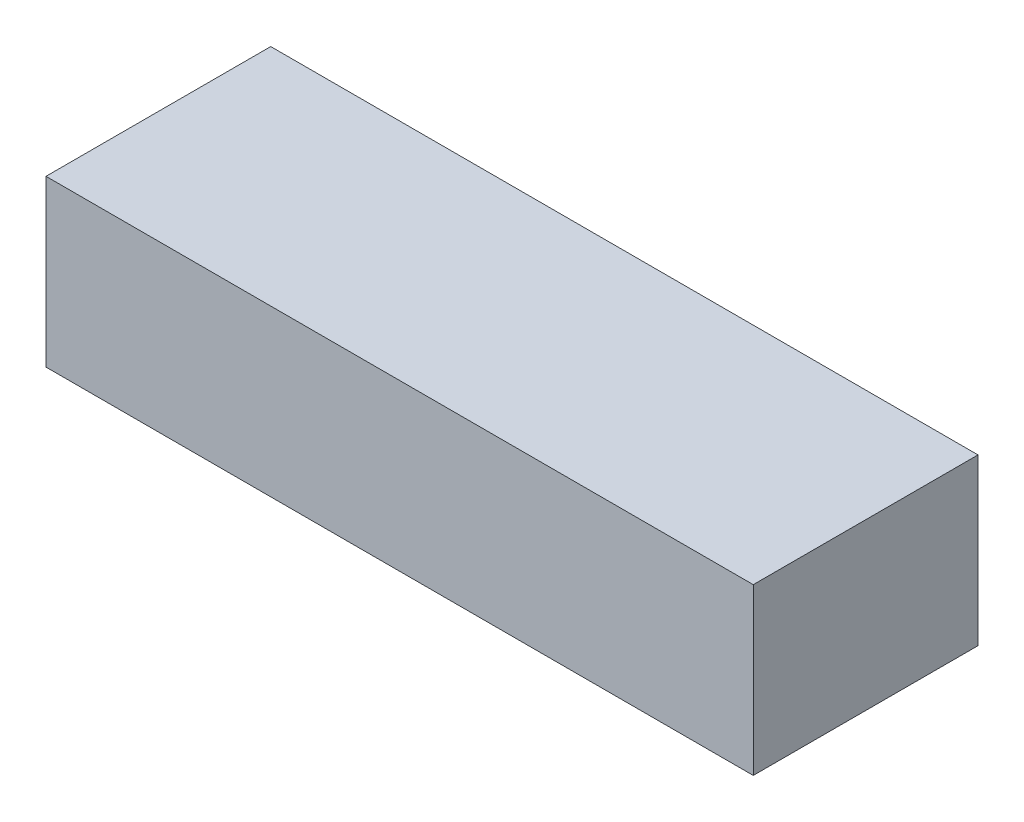
ISO-10303-21;
HEADER;
FILE_DESCRIPTION(('STEP AP214'),'2;1');
FILE_NAME('part.step','',(''),(''),'','','');
FILE_SCHEMA(('AUTOMOTIVE_DESIGN { 1 0 10303 214 1 1 1 1 }'));
ENDSEC;
DATA;
#1=APPLICATION_CONTEXT('core data for automotive mechanical design processes');
#2=APPLICATION_PROTOCOL_DEFINITION('international standard','automotive_design',2000,#1);
#3=PRODUCT_CONTEXT('',#1,'mechanical');
#4=PRODUCT('Part','Part','',(#3));
#5=PRODUCT_RELATED_PRODUCT_CATEGORY('part','',(#4));
#6=PRODUCT_DEFINITION_FORMATION('','',#4);
#7=PRODUCT_DEFINITION_CONTEXT('part definition',#1,'design');
#8=PRODUCT_DEFINITION('design','',#6,#7);
#9=PRODUCT_DEFINITION_SHAPE('','',#8);
#10=(LENGTH_UNIT() NAMED_UNIT(*) SI_UNIT(.MILLI.,.METRE.));
#11=(NAMED_UNIT(*) PLANE_ANGLE_UNIT() SI_UNIT($,.RADIAN.));
#12=(NAMED_UNIT(*) SI_UNIT($,.STERADIAN.) SOLID_ANGLE_UNIT());
#13=UNCERTAINTY_MEASURE_WITH_UNIT(LENGTH_MEASURE(1.E-05),#10,'distance_accuracy_value','');
#14=(GEOMETRIC_REPRESENTATION_CONTEXT(3) GLOBAL_UNCERTAINTY_ASSIGNED_CONTEXT((#13)) GLOBAL_UNIT_ASSIGNED_CONTEXT((#10,
#11,#12)) REPRESENTATION_CONTEXT('',''));
#15=CARTESIAN_POINT('',(0.,0.,0.));
#16=DIRECTION('',(0.,0.,1.));
#17=DIRECTION('',(1.,0.,0.));
#18=AXIS2_PLACEMENT_3D('',#15,#16,#17);
#19=CARTESIAN_POINT('',(53.5,25.,-17.));
#20=DIRECTION('',(-1.,0.,0.));
#21=DIRECTION('',(0.,0.,1.));
#22=AXIS2_PLACEMENT_3D('',#19,#20,#21);
#23=PLANE('',#22);
#24=DIRECTION('',(0.,0.,-1.));
#25=VECTOR('',#24,1.);
#26=CARTESIAN_POINT('',(53.5,0.,-17.));
#27=LINE('',#26,#25);
#28=CARTESIAN_POINT('',(53.5,0.,17.));
#29=VERTEX_POINT('',#28);
#30=CARTESIAN_POINT('',(53.5,0.,-17.));
#31=VERTEX_POINT('',#30);
#32=EDGE_CURVE('E100',#29,#31,#27,.T.);
#33=ORIENTED_EDGE('',*,*,#32,.T.);
#34=DIRECTION('',(0.,-1.,0.));
#35=VECTOR('',#34,1.);
#36=CARTESIAN_POINT('',(53.5,25.,-17.));
#37=LINE('',#36,#35);
#38=CARTESIAN_POINT('',(53.5,25.,-17.));
#39=VERTEX_POINT('',#38);
#40=EDGE_CURVE('E11',#39,#31,#37,.T.);
#41=ORIENTED_EDGE('',*,*,#40,.F.);
#42=DIRECTION('',(0.,0.,-1.));
#43=VECTOR('',#42,1.);
#44=CARTESIAN_POINT('',(53.5,25.,-17.));
#45=LINE('',#44,#43);
#46=CARTESIAN_POINT('',(53.5,25.,17.));
#47=VERTEX_POINT('',#46);
#48=EDGE_CURVE('E88',#47,#39,#45,.T.);
#49=ORIENTED_EDGE('',*,*,#48,.F.);
#50=DIRECTION('',(0.,-1.,0.));
#51=VECTOR('',#50,1.);
#52=CARTESIAN_POINT('',(53.5,25.,17.));
#53=LINE('',#52,#51);
#54=EDGE_CURVE('E96',#47,#29,#53,.T.);
#55=ORIENTED_EDGE('',*,*,#54,.T.);
#56=EDGE_LOOP('',(#33,#41,#49,#55));
#57=FACE_BOUND('',#56,.T.);
#58=ADVANCED_FACE('F37',(#57),#23,.F.);
#59=CARTESIAN_POINT('',(-53.5,25.,-17.));
#60=DIRECTION('',(0.,0.,1.));
#61=DIRECTION('',(1.,0.,0.));
#62=AXIS2_PLACEMENT_3D('',#59,#60,#61);
#63=PLANE('',#62);
#64=DIRECTION('',(-1.,0.,0.));
#65=VECTOR('',#64,1.);
#66=CARTESIAN_POINT('',(-53.5,0.,-17.));
#67=LINE('',#66,#65);
#68=CARTESIAN_POINT('',(-53.5,0.,-17.));
#69=VERTEX_POINT('',#68);
#70=EDGE_CURVE('E92',#31,#69,#67,.T.);
#71=ORIENTED_EDGE('',*,*,#70,.T.);
#72=DIRECTION('',(0.,-1.,0.));
#73=VECTOR('',#72,1.);
#74=CARTESIAN_POINT('',(-53.5,25.,-17.));
#75=LINE('',#74,#73);
#76=CARTESIAN_POINT('',(-53.5,25.,-17.));
#77=VERTEX_POINT('',#76);
#78=EDGE_CURVE('E45',#77,#69,#75,.T.);
#79=ORIENTED_EDGE('',*,*,#78,.F.);
#80=DIRECTION('',(-1.,0.,0.));
#81=VECTOR('',#80,1.);
#82=CARTESIAN_POINT('',(-53.5,25.,-17.));
#83=LINE('',#82,#81);
#84=EDGE_CURVE('E83',#39,#77,#83,.T.);
#85=ORIENTED_EDGE('',*,*,#84,.F.);
#86=ORIENTED_EDGE('',*,*,#40,.T.);
#87=EDGE_LOOP('',(#71,#79,#85,#86));
#88=FACE_BOUND('',#87,.T.);
#89=ADVANCED_FACE('F91',(#88),#63,.F.);
#90=CARTESIAN_POINT('',(-53.5,25.,-17.));
#91=DIRECTION('',(1.,0.,0.));
#92=DIRECTION('',(0.,0.,-1.));
#93=AXIS2_PLACEMENT_3D('',#90,#91,#92);
#94=PLANE('',#93);
#95=DIRECTION('',(0.,0.,1.));
#96=VECTOR('',#95,1.);
#97=CARTESIAN_POINT('',(-53.5,0.,-17.));
#98=LINE('',#97,#96);
#99=CARTESIAN_POINT('',(-53.5,0.,17.));
#100=VERTEX_POINT('',#99);
#101=EDGE_CURVE('E70',#69,#100,#98,.T.);
#102=ORIENTED_EDGE('',*,*,#101,.T.);
#103=DIRECTION('',(0.,-1.,0.));
#104=VECTOR('',#103,1.);
#105=CARTESIAN_POINT('',(-53.5,25.,17.));
#106=LINE('',#105,#104);
#107=CARTESIAN_POINT('',(-53.5,25.,17.));
#108=VERTEX_POINT('',#107);
#109=EDGE_CURVE('E93',#108,#100,#106,.T.);
#110=ORIENTED_EDGE('',*,*,#109,.F.);
#111=DIRECTION('',(0.,0.,1.));
#112=VECTOR('',#111,1.);
#113=CARTESIAN_POINT('',(-53.5,25.,-17.));
#114=LINE('',#113,#112);
#115=EDGE_CURVE('E86',#77,#108,#114,.T.);
#116=ORIENTED_EDGE('',*,*,#115,.F.);
#117=ORIENTED_EDGE('',*,*,#78,.T.);
#118=EDGE_LOOP('',(#102,#110,#116,#117));
#119=FACE_BOUND('',#118,.T.);
#120=ADVANCED_FACE('F94',(#119),#94,.F.);
#121=CARTESIAN_POINT('',(-53.5,25.,17.));
#122=DIRECTION('',(0.,0.,-1.));
#123=DIRECTION('',(-1.,0.,0.));
#124=AXIS2_PLACEMENT_3D('',#121,#122,#123);
#125=PLANE('',#124);
#126=DIRECTION('',(1.,0.,0.));
#127=VECTOR('',#126,1.);
#128=CARTESIAN_POINT('',(-53.5,0.,17.));
#129=LINE('',#128,#127);
#130=EDGE_CURVE('E76',#100,#29,#129,.T.);
#131=ORIENTED_EDGE('',*,*,#130,.T.);
#132=ORIENTED_EDGE('',*,*,#54,.F.);
#133=DIRECTION('',(1.,0.,0.));
#134=VECTOR('',#133,1.);
#135=CARTESIAN_POINT('',(-53.5,25.,17.));
#136=LINE('',#135,#134);
#137=EDGE_CURVE('E53',#108,#47,#136,.T.);
#138=ORIENTED_EDGE('',*,*,#137,.F.);
#139=ORIENTED_EDGE('',*,*,#109,.T.);
#140=EDGE_LOOP('',(#131,#132,#138,#139));
#141=FACE_BOUND('',#140,.T.);
#142=ADVANCED_FACE('F107',(#141),#125,.F.);
#143=CARTESIAN_POINT('',(0.,25.,0.));
#144=DIRECTION('',(0.,1.,0.));
#145=DIRECTION('',(0.,0.,1.));
#146=AXIS2_PLACEMENT_3D('',#143,#144,#145);
#147=PLANE('',#146);
#148=ORIENTED_EDGE('',*,*,#48,.T.);
#149=ORIENTED_EDGE('',*,*,#84,.T.);
#150=ORIENTED_EDGE('',*,*,#115,.T.);
#151=ORIENTED_EDGE('',*,*,#137,.T.);
#152=EDGE_LOOP('',(#148,#149,#150,#151));
#153=FACE_BOUND('',#152,.T.);
#154=ADVANCED_FACE('F84',(#153),#147,.T.);
#155=CARTESIAN_POINT('',(0.,0.,0.));
#156=DIRECTION('',(0.,1.,0.));
#157=DIRECTION('',(0.,0.,1.));
#158=AXIS2_PLACEMENT_3D('',#155,#156,#157);
#159=PLANE('',#158);
#160=ORIENTED_EDGE('',*,*,#32,.F.);
#161=ORIENTED_EDGE('',*,*,#130,.F.);
#162=ORIENTED_EDGE('',*,*,#101,.F.);
#163=ORIENTED_EDGE('',*,*,#70,.F.);
#164=EDGE_LOOP('',(#160,#161,#162,#163));
#165=FACE_BOUND('',#164,.T.);
#166=ADVANCED_FACE('F110',(#165),#159,.F.);
#167=CLOSED_SHELL('',(#58,#89,#120,#142,#154,#166));
#168=MANIFOLD_SOLID_BREP('B2',#167);
#169=ADVANCED_BREP_SHAPE_REPRESENTATION('',(#18,#168),#14);
#170=SHAPE_DEFINITION_REPRESENTATION(#9,#169);
ENDSEC;
END-ISO-10303-21;
